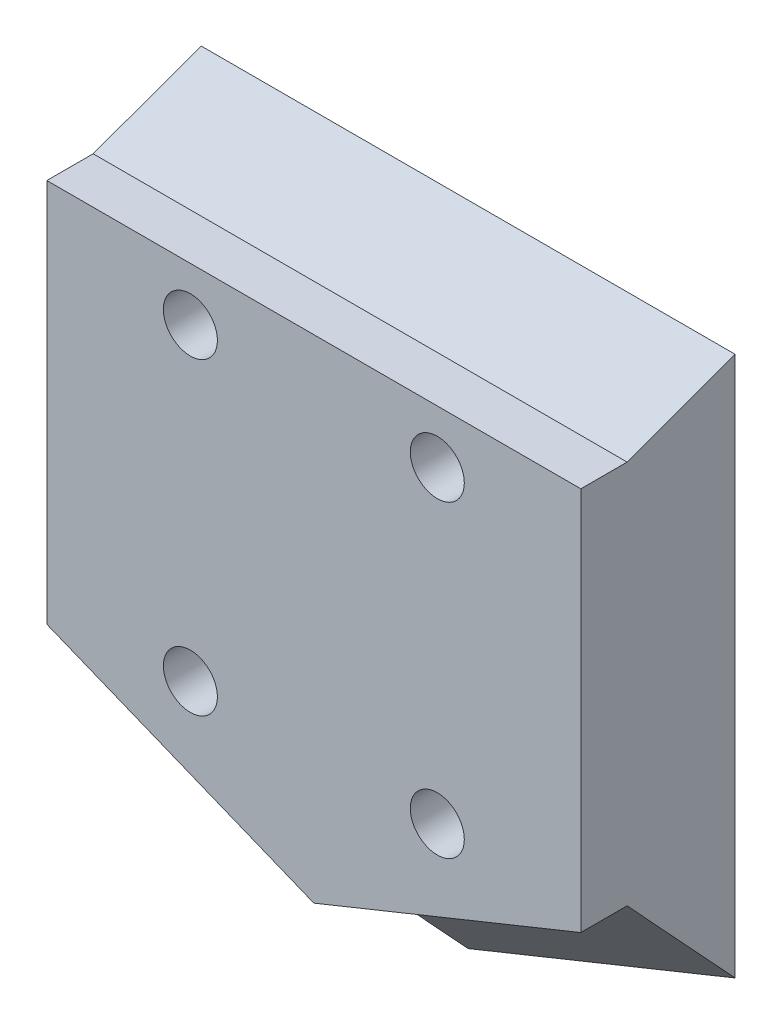
ISO-10303-21;
HEADER;
FILE_DESCRIPTION(('STEP AP214'),'2;1');
FILE_NAME('part.step','',(''),(''),'','','');
FILE_SCHEMA(('AUTOMOTIVE_DESIGN { 1 0 10303 214 1 1 1 1 }'));
ENDSEC;
DATA;
#1=APPLICATION_CONTEXT('core data for automotive mechanical design processes');
#2=APPLICATION_PROTOCOL_DEFINITION('international standard','automotive_design',2000,#1);
#3=PRODUCT_CONTEXT('',#1,'mechanical');
#4=PRODUCT('Part','Part','',(#3));
#5=PRODUCT_RELATED_PRODUCT_CATEGORY('part','',(#4));
#6=PRODUCT_DEFINITION_FORMATION('','',#4);
#7=PRODUCT_DEFINITION_CONTEXT('part definition',#1,'design');
#8=PRODUCT_DEFINITION('design','',#6,#7);
#9=PRODUCT_DEFINITION_SHAPE('','',#8);
#10=(LENGTH_UNIT() NAMED_UNIT(*) SI_UNIT(.MILLI.,.METRE.));
#11=(NAMED_UNIT(*) PLANE_ANGLE_UNIT() SI_UNIT($,.RADIAN.));
#12=(NAMED_UNIT(*) SI_UNIT($,.STERADIAN.) SOLID_ANGLE_UNIT());
#13=UNCERTAINTY_MEASURE_WITH_UNIT(LENGTH_MEASURE(1.E-05),#10,'distance_accuracy_value','');
#14=(GEOMETRIC_REPRESENTATION_CONTEXT(3) GLOBAL_UNCERTAINTY_ASSIGNED_CONTEXT((#13)) GLOBAL_UNIT_ASSIGNED_CONTEXT((#10,
#11,#12)) REPRESENTATION_CONTEXT('',''));
#15=CARTESIAN_POINT('',(0.,0.,0.));
#16=DIRECTION('',(0.,0.,1.));
#17=DIRECTION('',(1.,0.,0.));
#18=AXIS2_PLACEMENT_3D('',#15,#16,#17);
#19=CARTESIAN_POINT('',(-8.,9.5,0.));
#20=DIRECTION('',(0.,0.,1.));
#21=DIRECTION('',(1.,0.,0.));
#22=AXIS2_PLACEMENT_3D('',#19,#20,#21);
#23=CYLINDRICAL_SURFACE('',#22,1.75);
#24=CARTESIAN_POINT('',(-8.,9.5,10.));
#25=DIRECTION('',(0.,0.,1.));
#26=DIRECTION('',(-1.,0.,0.));
#27=AXIS2_PLACEMENT_3D('',#24,#25,#26);
#28=CIRCLE('',#27,1.75);
#29=CARTESIAN_POINT('',(-9.75,9.5,10.));
#30=VERTEX_POINT('',#29);
#31=EDGE_CURVE('E153',#30,#30,#28,.T.);
#32=ORIENTED_EDGE('',*,*,#31,.T.);
#33=EDGE_LOOP('',(#32));
#34=FACE_BOUND('',#33,.T.);
#35=CARTESIAN_POINT('',(-8.,9.5,3.));
#36=DIRECTION('',(0.,0.,-1.));
#37=DIRECTION('',(-1.,0.,0.));
#38=AXIS2_PLACEMENT_3D('',#35,#36,#37);
#39=CIRCLE('',#38,1.75);
#40=CARTESIAN_POINT('',(-9.75,9.5,3.));
#41=VERTEX_POINT('',#40);
#42=EDGE_CURVE('E39',#41,#41,#39,.F.);
#43=ORIENTED_EDGE('',*,*,#42,.F.);
#44=EDGE_LOOP('',(#43));
#45=FACE_BOUND('',#44,.T.);
#46=ADVANCED_FACE('F35',(#34,#45),#23,.F.);
#47=CARTESIAN_POINT('',(-8.,-10.5,0.));
#48=DIRECTION('',(0.,0.,1.));
#49=DIRECTION('',(1.,0.,0.));
#50=AXIS2_PLACEMENT_3D('',#47,#48,#49);
#51=CYLINDRICAL_SURFACE('',#50,1.75);
#52=CARTESIAN_POINT('',(-8.,-10.5,10.));
#53=DIRECTION('',(0.,0.,1.));
#54=DIRECTION('',(-1.,0.,0.));
#55=AXIS2_PLACEMENT_3D('',#52,#53,#54);
#56=CIRCLE('',#55,1.75);
#57=CARTESIAN_POINT('',(-9.75,-10.5,10.));
#58=VERTEX_POINT('',#57);
#59=EDGE_CURVE('E177',#58,#58,#56,.T.);
#60=ORIENTED_EDGE('',*,*,#59,.T.);
#61=EDGE_LOOP('',(#60));
#62=FACE_BOUND('',#61,.T.);
#63=CARTESIAN_POINT('',(-8.,-10.5,3.));
#64=DIRECTION('',(0.,0.,-1.));
#65=DIRECTION('',(-1.,0.,0.));
#66=AXIS2_PLACEMENT_3D('',#63,#64,#65);
#67=CIRCLE('',#66,1.75);
#68=CARTESIAN_POINT('',(-9.75,-10.5,3.));
#69=VERTEX_POINT('',#68);
#70=EDGE_CURVE('E157',#69,#69,#67,.F.);
#71=ORIENTED_EDGE('',*,*,#70,.F.);
#72=EDGE_LOOP('',(#71));
#73=FACE_BOUND('',#72,.T.);
#74=ADVANCED_FACE('F224',(#62,#73),#51,.F.);
#75=CARTESIAN_POINT('',(8.,-10.5,0.));
#76=DIRECTION('',(0.,0.,1.));
#77=DIRECTION('',(1.,0.,0.));
#78=AXIS2_PLACEMENT_3D('',#75,#76,#77);
#79=CYLINDRICAL_SURFACE('',#78,1.75);
#80=CARTESIAN_POINT('',(8.,-10.5,10.));
#81=DIRECTION('',(0.,0.,1.));
#82=DIRECTION('',(1.,0.,0.));
#83=AXIS2_PLACEMENT_3D('',#80,#81,#82);
#84=CIRCLE('',#83,1.75);
#85=CARTESIAN_POINT('',(9.75,-10.5,10.));
#86=VERTEX_POINT('',#85);
#87=EDGE_CURVE('E174',#86,#86,#84,.T.);
#88=ORIENTED_EDGE('',*,*,#87,.T.);
#89=EDGE_LOOP('',(#88));
#90=FACE_BOUND('',#89,.T.);
#91=CARTESIAN_POINT('',(8.,-10.5,3.));
#92=DIRECTION('',(0.,0.,-1.));
#93=DIRECTION('',(-1.,0.,0.));
#94=AXIS2_PLACEMENT_3D('',#91,#92,#93);
#95=CIRCLE('',#94,1.75);
#96=CARTESIAN_POINT('',(6.25,-10.5,3.));
#97=VERTEX_POINT('',#96);
#98=EDGE_CURVE('E155',#97,#97,#95,.F.);
#99=ORIENTED_EDGE('',*,*,#98,.F.);
#100=EDGE_LOOP('',(#99));
#101=FACE_BOUND('',#100,.T.);
#102=ADVANCED_FACE('F230',(#90,#101),#79,.F.);
#103=CARTESIAN_POINT('',(8.,9.50000000000001,0.));
#104=DIRECTION('',(0.,0.,1.));
#105=DIRECTION('',(1.,0.,0.));
#106=AXIS2_PLACEMENT_3D('',#103,#104,#105);
#107=CYLINDRICAL_SURFACE('',#106,1.75);
#108=CARTESIAN_POINT('',(8.,9.50000000000001,10.));
#109=DIRECTION('',(0.,0.,1.));
#110=DIRECTION('',(1.,0.,0.));
#111=AXIS2_PLACEMENT_3D('',#108,#109,#110);
#112=CIRCLE('',#111,1.75);
#113=CARTESIAN_POINT('',(9.75,9.50000000000001,10.));
#114=VERTEX_POINT('',#113);
#115=EDGE_CURVE('E116',#114,#114,#112,.T.);
#116=ORIENTED_EDGE('',*,*,#115,.T.);
#117=EDGE_LOOP('',(#116));
#118=FACE_BOUND('',#117,.T.);
#119=CARTESIAN_POINT('',(8.,9.50000000000001,3.));
#120=DIRECTION('',(0.,0.,-1.));
#121=DIRECTION('',(-1.,0.,0.));
#122=AXIS2_PLACEMENT_3D('',#119,#120,#121);
#123=CIRCLE('',#122,1.75);
#124=CARTESIAN_POINT('',(6.25,9.50000000000001,3.));
#125=VERTEX_POINT('',#124);
#126=EDGE_CURVE('E150',#125,#125,#123,.F.);
#127=ORIENTED_EDGE('',*,*,#126,.F.);
#128=EDGE_LOOP('',(#127));
#129=FACE_BOUND('',#128,.T.);
#130=ADVANCED_FACE('F236',(#118,#129),#107,.F.);
#131=CARTESIAN_POINT('',(17.3,13.,7.));
#132=DIRECTION('',(-1.,0.,0.));
#133=DIRECTION('',(0.,0.,1.));
#134=AXIS2_PLACEMENT_3D('',#131,#132,#133);
#135=PLANE('',#134);
#136=DIRECTION('',(0.,1.,0.));
#137=VECTOR('',#136,1.);
#138=CARTESIAN_POINT('',(17.3,13.,0.));
#139=LINE('',#138,#137);
#140=CARTESIAN_POINT('',(17.3,-19.5,0.));
#141=VERTEX_POINT('',#140);
#142=CARTESIAN_POINT('',(17.3,15.5,0.));
#143=VERTEX_POINT('',#142);
#144=EDGE_CURVE('E136',#141,#143,#139,.T.);
#145=ORIENTED_EDGE('',*,*,#144,.T.);
#146=DIRECTION('',(0.,0.342020143325666,-0.939692620785909));
#147=VECTOR('',#146,1.);
#148=CARTESIAN_POINT('',(17.3,15.5,0.));
#149=LINE('',#148,#147);
#150=CARTESIAN_POINT('',(17.3,12.9522083601366,7.));
#151=VERTEX_POINT('',#150);
#152=EDGE_CURVE('E58',#143,#151,#149,.F.);
#153=ORIENTED_EDGE('',*,*,#152,.T.);
#154=DIRECTION('',(0.,0.,-1.));
#155=VECTOR('',#154,1.);
#156=CARTESIAN_POINT('',(17.3,12.9522083601366,10.));
#157=LINE('',#156,#155);
#158=CARTESIAN_POINT('',(17.3,12.9522083601366,10.));
#159=VERTEX_POINT('',#158);
#160=EDGE_CURVE('E103',#159,#151,#157,.T.);
#161=ORIENTED_EDGE('',*,*,#160,.F.);
#162=DIRECTION('',(0.,1.,0.));
#163=VECTOR('',#162,1.);
#164=CARTESIAN_POINT('',(17.3,-11.9486875651011,10.));
#165=LINE('',#164,#163);
#166=CARTESIAN_POINT('',(17.3,-11.9486875651011,10.));
#167=VERTEX_POINT('',#166);
#168=EDGE_CURVE('E96',#167,#159,#165,.T.);
#169=ORIENTED_EDGE('',*,*,#168,.F.);
#170=DIRECTION('',(0.,0.,-1.));
#171=VECTOR('',#170,1.);
#172=CARTESIAN_POINT('',(17.3,-11.9486875651011,10.));
#173=LINE('',#172,#171);
#174=CARTESIAN_POINT('',(17.3,-11.9486875651011,7.));
#175=VERTEX_POINT('',#174);
#176=EDGE_CURVE('E100',#167,#175,#173,.T.);
#177=ORIENTED_EDGE('',*,*,#176,.T.);
#178=DIRECTION('',(0.,0.733371095333155,0.679828534654032));
#179=VECTOR('',#178,1.);
#180=CARTESIAN_POINT('',(17.3,-19.5,0.));
#181=LINE('',#180,#179);
#182=EDGE_CURVE('E144',#175,#141,#181,.F.);
#183=ORIENTED_EDGE('',*,*,#182,.T.);
#184=EDGE_LOOP('',(#145,#153,#161,#169,#177,#183));
#185=FACE_BOUND('',#184,.T.);
#186=ADVANCED_FACE('F98',(#185),#135,.F.);
#187=CARTESIAN_POINT('',(-17.3,13.,7.));
#188=DIRECTION('',(1.,0.,0.));
#189=DIRECTION('',(0.,1.,0.));
#190=AXIS2_PLACEMENT_3D('',#187,#188,#189);
#191=PLANE('',#190);
#192=DIRECTION('',(0.,-0.733371095333155,-0.679828534654032));
#193=VECTOR('',#192,1.);
#194=CARTESIAN_POINT('',(-17.3,-23.2648321442911,-3.48996617968573));
#195=LINE('',#194,#193);
#196=CARTESIAN_POINT('',(-17.3,-19.5,0.));
#197=VERTEX_POINT('',#196);
#198=CARTESIAN_POINT('',(-17.3,-11.9486875651011,7.));
#199=VERTEX_POINT('',#198);
#200=EDGE_CURVE('E146',#197,#199,#195,.F.);
#201=ORIENTED_EDGE('',*,*,#200,.T.);
#202=DIRECTION('',(0.,0.,-1.));
#203=VECTOR('',#202,1.);
#204=CARTESIAN_POINT('',(-17.3,-11.9486875651011,10.));
#205=LINE('',#204,#203);
#206=CARTESIAN_POINT('',(-17.3,-11.9486875651011,10.));
#207=VERTEX_POINT('',#206);
#208=EDGE_CURVE('E190',#207,#199,#205,.T.);
#209=ORIENTED_EDGE('',*,*,#208,.F.);
#210=DIRECTION('',(0.,-1.,0.));
#211=VECTOR('',#210,1.);
#212=CARTESIAN_POINT('',(-17.3,12.9522083601366,10.));
#213=LINE('',#212,#211);
#214=CARTESIAN_POINT('',(-17.3,12.9522083601366,10.));
#215=VERTEX_POINT('',#214);
#216=EDGE_CURVE('E185',#215,#207,#213,.T.);
#217=ORIENTED_EDGE('',*,*,#216,.F.);
#218=DIRECTION('',(0.,0.,-1.));
#219=VECTOR('',#218,1.);
#220=CARTESIAN_POINT('',(-17.3,12.9522083601366,10.));
#221=LINE('',#220,#219);
#222=CARTESIAN_POINT('',(-17.3,12.9522083601366,7.));
#223=VERTEX_POINT('',#222);
#224=EDGE_CURVE('E124',#215,#223,#221,.T.);
#225=ORIENTED_EDGE('',*,*,#224,.T.);
#226=DIRECTION('',(0.,-0.342020143325666,0.939692620785909));
#227=VECTOR('',#226,1.);
#228=CARTESIAN_POINT('',(-17.3,15.5,0.));
#229=LINE('',#228,#227);
#230=CARTESIAN_POINT('',(-17.3,15.5,0.));
#231=VERTEX_POINT('',#230);
#232=EDGE_CURVE('E11',#223,#231,#229,.F.);
#233=ORIENTED_EDGE('',*,*,#232,.T.);
#234=DIRECTION('',(0.,-1.,0.));
#235=VECTOR('',#234,1.);
#236=CARTESIAN_POINT('',(-17.3,13.,0.));
#237=LINE('',#236,#235);
#238=EDGE_CURVE('E138',#231,#197,#237,.T.);
#239=ORIENTED_EDGE('',*,*,#238,.T.);
#240=EDGE_LOOP('',(#201,#209,#217,#225,#233,#239));
#241=FACE_BOUND('',#240,.T.);
#242=ADVANCED_FACE('F196',(#241),#191,.F.);
#243=CARTESIAN_POINT('',(0.,0.,0.));
#244=DIRECTION('',(0.,0.,1.));
#245=DIRECTION('',(1.,0.,0.));
#246=AXIS2_PLACEMENT_3D('',#243,#244,#245);
#247=PLANE('',#246);
#248=CARTESIAN_POINT('',(-8.,9.5,0.));
#249=DIRECTION('',(0.,0.,-1.));
#250=DIRECTION('',(-1.,0.,0.));
#251=AXIS2_PLACEMENT_3D('',#248,#249,#250);
#252=CIRCLE('',#251,3.5);
#253=CARTESIAN_POINT('',(-11.5,9.5,0.));
#254=VERTEX_POINT('',#253);
#255=EDGE_CURVE('E286',#254,#254,#252,.T.);
#256=ORIENTED_EDGE('',*,*,#255,.F.);
#257=EDGE_LOOP('',(#256));
#258=FACE_BOUND('',#257,.T.);
#259=CARTESIAN_POINT('',(8.,-10.5,0.));
#260=DIRECTION('',(0.,0.,-1.));
#261=DIRECTION('',(-1.,0.,0.));
#262=AXIS2_PLACEMENT_3D('',#259,#260,#261);
#263=CIRCLE('',#262,3.5);
#264=CARTESIAN_POINT('',(4.5,-10.5,0.));
#265=VERTEX_POINT('',#264);
#266=EDGE_CURVE('E294',#265,#265,#263,.T.);
#267=ORIENTED_EDGE('',*,*,#266,.F.);
#268=EDGE_LOOP('',(#267));
#269=FACE_BOUND('',#268,.T.);
#270=CARTESIAN_POINT('',(-8.,-10.5,0.));
#271=DIRECTION('',(0.,0.,-1.));
#272=DIRECTION('',(-1.,0.,0.));
#273=AXIS2_PLACEMENT_3D('',#270,#271,#272);
#274=CIRCLE('',#273,3.5);
#275=CARTESIAN_POINT('',(-11.5,-10.5,0.));
#276=VERTEX_POINT('',#275);
#277=EDGE_CURVE('E299',#276,#276,#274,.T.);
#278=ORIENTED_EDGE('',*,*,#277,.F.);
#279=EDGE_LOOP('',(#278));
#280=FACE_BOUND('',#279,.T.);
#281=CARTESIAN_POINT('',(8.,9.50000000000001,0.));
#282=DIRECTION('',(0.,0.,-1.));
#283=DIRECTION('',(-1.,0.,0.));
#284=AXIS2_PLACEMENT_3D('',#281,#282,#283);
#285=CIRCLE('',#284,3.5);
#286=CARTESIAN_POINT('',(4.5,9.50000000000001,0.));
#287=VERTEX_POINT('',#286);
#288=EDGE_CURVE('E163',#287,#287,#285,.T.);
#289=ORIENTED_EDGE('',*,*,#288,.F.);
#290=EDGE_LOOP('',(#289));
#291=FACE_BOUND('',#290,.T.);
#292=ORIENTED_EDGE('',*,*,#144,.F.);
#293=DIRECTION('',(-0.926991176745522,-0.375083135099344,0.));
#294=VECTOR('',#293,1.);
#295=CARTESIAN_POINT('',(17.3,-19.5,0.));
#296=LINE('',#295,#294);
#297=CARTESIAN_POINT('',(0.,-26.5,0.));
#298=VERTEX_POINT('',#297);
#299=EDGE_CURVE('E122',#141,#298,#296,.T.);
#300=ORIENTED_EDGE('',*,*,#299,.T.);
#301=DIRECTION('',(-0.926991176745522,0.375083135099344,0.));
#302=VECTOR('',#301,1.);
#303=CARTESIAN_POINT('',(0.,-26.5,0.));
#304=LINE('',#303,#302);
#305=EDGE_CURVE('E128',#298,#197,#304,.T.);
#306=ORIENTED_EDGE('',*,*,#305,.T.);
#307=ORIENTED_EDGE('',*,*,#238,.F.);
#308=DIRECTION('',(1.,0.,0.));
#309=VECTOR('',#308,1.);
#310=CARTESIAN_POINT('',(17.3,15.5,0.));
#311=LINE('',#310,#309);
#312=EDGE_CURVE('E131',#231,#143,#311,.T.);
#313=ORIENTED_EDGE('',*,*,#312,.T.);
#314=EDGE_LOOP('',(#292,#300,#306,#307,#313));
#315=FACE_BOUND('',#314,.T.);
#316=ADVANCED_FACE('F204',(#258,#269,#280,#291,#315),#247,.F.);
#317=CARTESIAN_POINT('',(0.,-26.5,0.));
#318=DIRECTION('',(0.265223828337456,0.655481747176855,-0.707106781186549));
#319=DIRECTION('',(-0.926991176745522,0.375083135099344,0.));
#320=AXIS2_PLACEMENT_3D('',#317,#318,#319);
#321=PLANE('',#320);
#322=ORIENTED_EDGE('',*,*,#200,.F.);
#323=ORIENTED_EDGE('',*,*,#305,.F.);
#324=DIRECTION('',(0.,0.733371095333155,0.679828534654032));
#325=VECTOR('',#324,1.);
#326=CARTESIAN_POINT('',(0.,-26.5,0.));
#327=LINE('',#326,#325);
#328=CARTESIAN_POINT('',(0.,-18.9486875651011,7.));
#329=VERTEX_POINT('',#328);
#330=EDGE_CURVE('E120',#329,#298,#327,.F.);
#331=ORIENTED_EDGE('',*,*,#330,.F.);
#332=DIRECTION('',(0.926991176745522,-0.375083135099344,0.));
#333=VECTOR('',#332,1.);
#334=CARTESIAN_POINT('',(-6.5884351090578,-16.2828467695286,7.));
#335=LINE('',#334,#333);
#336=EDGE_CURVE('E140',#199,#329,#335,.T.);
#337=ORIENTED_EDGE('',*,*,#336,.F.);
#338=EDGE_LOOP('',(#322,#323,#331,#337));
#339=FACE_BOUND('',#338,.T.);
#340=ADVANCED_FACE('F210',(#339),#321,.F.);
#341=CARTESIAN_POINT('',(17.3,-19.5,0.));
#342=DIRECTION('',(-0.265223828337456,0.655481747176855,-0.707106781186549));
#343=DIRECTION('',(-0.926991176745522,-0.375083135099344,0.));
#344=AXIS2_PLACEMENT_3D('',#341,#342,#343);
#345=PLANE('',#344);
#346=ORIENTED_EDGE('',*,*,#182,.F.);
#347=DIRECTION('',(0.926991176745522,0.375083135099344,0.));
#348=VECTOR('',#347,1.);
#349=CARTESIAN_POINT('',(6.5884351090578,-16.2828467695286,7.));
#350=LINE('',#349,#348);
#351=EDGE_CURVE('E119',#329,#175,#350,.T.);
#352=ORIENTED_EDGE('',*,*,#351,.F.);
#353=ORIENTED_EDGE('',*,*,#330,.T.);
#354=ORIENTED_EDGE('',*,*,#299,.F.);
#355=EDGE_LOOP('',(#346,#352,#353,#354));
#356=FACE_BOUND('',#355,.T.);
#357=ADVANCED_FACE('F312',(#356),#345,.F.);
#358=CARTESIAN_POINT('',(17.3,15.5,0.));
#359=DIRECTION('',(0.,-0.939692620785909,-0.342020143325666));
#360=DIRECTION('',(1.,0.,0.));
#361=AXIS2_PLACEMENT_3D('',#358,#359,#360);
#362=PLANE('',#361);
#363=ORIENTED_EDGE('',*,*,#232,.F.);
#364=DIRECTION('',(-1.,0.,0.));
#365=VECTOR('',#364,1.);
#366=CARTESIAN_POINT('',(0.,12.9522083601366,7.));
#367=LINE('',#366,#365);
#368=EDGE_CURVE('E44',#151,#223,#367,.T.);
#369=ORIENTED_EDGE('',*,*,#368,.F.);
#370=ORIENTED_EDGE('',*,*,#152,.F.);
#371=ORIENTED_EDGE('',*,*,#312,.F.);
#372=EDGE_LOOP('',(#363,#369,#370,#371));
#373=FACE_BOUND('',#372,.T.);
#374=ADVANCED_FACE('F37',(#373),#362,.F.);
#375=CARTESIAN_POINT('',(0.,-18.9486875651011,10.));
#376=DIRECTION('',(-0.375083135099344,0.926991176745522,0.));
#377=DIRECTION('',(-0.926991176745522,-0.375083135099344,0.));
#378=AXIS2_PLACEMENT_3D('',#375,#376,#377);
#379=PLANE('',#378);
#380=ORIENTED_EDGE('',*,*,#351,.T.);
#381=ORIENTED_EDGE('',*,*,#176,.F.);
#382=DIRECTION('',(0.926991176745522,0.375083135099345,0.));
#383=VECTOR('',#382,1.);
#384=CARTESIAN_POINT('',(0.,-18.9486875651011,10.));
#385=LINE('',#384,#383);
#386=CARTESIAN_POINT('',(0.,-18.9486875651011,10.));
#387=VERTEX_POINT('',#386);
#388=EDGE_CURVE('E107',#387,#167,#385,.T.);
#389=ORIENTED_EDGE('',*,*,#388,.F.);
#390=DIRECTION('',(0.,0.,-1.));
#391=VECTOR('',#390,1.);
#392=CARTESIAN_POINT('',(0.,-18.9486875651011,10.));
#393=LINE('',#392,#391);
#394=EDGE_CURVE('E188',#387,#329,#393,.T.);
#395=ORIENTED_EDGE('',*,*,#394,.T.);
#396=EDGE_LOOP('',(#380,#381,#389,#395));
#397=FACE_BOUND('',#396,.T.);
#398=ADVANCED_FACE('F118',(#397),#379,.F.);
#399=CARTESIAN_POINT('',(17.3,12.9522083601366,10.));
#400=DIRECTION('',(0.,-1.,0.));
#401=DIRECTION('',(0.,0.,-1.));
#402=AXIS2_PLACEMENT_3D('',#399,#400,#401);
#403=PLANE('',#402);
#404=ORIENTED_EDGE('',*,*,#368,.T.);
#405=ORIENTED_EDGE('',*,*,#224,.F.);
#406=DIRECTION('',(-1.,0.,0.));
#407=VECTOR('',#406,1.);
#408=CARTESIAN_POINT('',(17.3,12.9522083601366,10.));
#409=LINE('',#408,#407);
#410=EDGE_CURVE('E106',#159,#215,#409,.T.);
#411=ORIENTED_EDGE('',*,*,#410,.F.);
#412=ORIENTED_EDGE('',*,*,#160,.T.);
#413=EDGE_LOOP('',(#404,#405,#411,#412));
#414=FACE_BOUND('',#413,.T.);
#415=ADVANCED_FACE('F200',(#414),#403,.F.);
#416=CARTESIAN_POINT('',(-17.3,-11.9486875651011,10.));
#417=DIRECTION('',(0.375083135099344,0.926991176745522,0.));
#418=DIRECTION('',(-0.926991176745522,0.375083135099345,0.));
#419=AXIS2_PLACEMENT_3D('',#416,#417,#418);
#420=PLANE('',#419);
#421=ORIENTED_EDGE('',*,*,#336,.T.);
#422=ORIENTED_EDGE('',*,*,#394,.F.);
#423=DIRECTION('',(0.926991176745521,-0.375083135099344,0.));
#424=VECTOR('',#423,1.);
#425=CARTESIAN_POINT('',(-17.3,-11.9486875651011,10.));
#426=LINE('',#425,#424);
#427=EDGE_CURVE('E112',#207,#387,#426,.T.);
#428=ORIENTED_EDGE('',*,*,#427,.F.);
#429=ORIENTED_EDGE('',*,*,#208,.T.);
#430=EDGE_LOOP('',(#421,#422,#428,#429));
#431=FACE_BOUND('',#430,.T.);
#432=ADVANCED_FACE('F212',(#431),#420,.F.);
#433=CARTESIAN_POINT('',(0.,0.,10.));
#434=DIRECTION('',(0.,0.,1.));
#435=DIRECTION('',(1.,0.,0.));
#436=AXIS2_PLACEMENT_3D('',#433,#434,#435);
#437=PLANE('',#436);
#438=ORIENTED_EDGE('',*,*,#87,.F.);
#439=EDGE_LOOP('',(#438));
#440=FACE_BOUND('',#439,.T.);
#441=ORIENTED_EDGE('',*,*,#59,.F.);
#442=EDGE_LOOP('',(#441));
#443=FACE_BOUND('',#442,.T.);
#444=ORIENTED_EDGE('',*,*,#31,.F.);
#445=EDGE_LOOP('',(#444));
#446=FACE_BOUND('',#445,.T.);
#447=ORIENTED_EDGE('',*,*,#115,.F.);
#448=EDGE_LOOP('',(#447));
#449=FACE_BOUND('',#448,.T.);
#450=ORIENTED_EDGE('',*,*,#388,.T.);
#451=ORIENTED_EDGE('',*,*,#168,.T.);
#452=ORIENTED_EDGE('',*,*,#410,.T.);
#453=ORIENTED_EDGE('',*,*,#216,.T.);
#454=ORIENTED_EDGE('',*,*,#427,.T.);
#455=EDGE_LOOP('',(#450,#451,#452,#453,#454));
#456=FACE_BOUND('',#455,.T.);
#457=ADVANCED_FACE('F110',(#440,#443,#446,#449,#456),#437,.T.);
#458=CARTESIAN_POINT('',(8.,9.50000000000001,3.));
#459=DIRECTION('',(0.,0.,-1.));
#460=DIRECTION('',(-1.,0.,0.));
#461=AXIS2_PLACEMENT_3D('',#458,#459,#460);
#462=PLANE('',#461);
#463=CARTESIAN_POINT('',(8.,9.50000000000001,3.));
#464=DIRECTION('',(0.,0.,-1.));
#465=DIRECTION('',(-1.,0.,0.));
#466=AXIS2_PLACEMENT_3D('',#463,#464,#465);
#467=CIRCLE('',#466,3.5);
#468=CARTESIAN_POINT('',(4.5,9.50000000000001,3.));
#469=VERTEX_POINT('',#468);
#470=EDGE_CURVE('E154',#469,#469,#467,.T.);
#471=ORIENTED_EDGE('',*,*,#470,.T.);
#472=EDGE_LOOP('',(#471));
#473=FACE_BOUND('',#472,.T.);
#474=ORIENTED_EDGE('',*,*,#126,.T.);
#475=EDGE_LOOP('',(#474));
#476=FACE_BOUND('',#475,.T.);
#477=ADVANCED_FACE('F219',(#473,#476),#462,.T.);
#478=CARTESIAN_POINT('',(8.,9.50000000000001,3.));
#479=DIRECTION('',(0.,0.,-1.));
#480=DIRECTION('',(-1.,0.,0.));
#481=AXIS2_PLACEMENT_3D('',#478,#479,#480);
#482=CYLINDRICAL_SURFACE('',#481,3.5);
#483=ORIENTED_EDGE('',*,*,#470,.F.);
#484=EDGE_LOOP('',(#483));
#485=FACE_BOUND('',#484,.T.);
#486=ORIENTED_EDGE('',*,*,#288,.T.);
#487=EDGE_LOOP('',(#486));
#488=FACE_BOUND('',#487,.T.);
#489=ADVANCED_FACE('F250',(#485,#488),#482,.F.);
#490=CARTESIAN_POINT('',(8.,-10.5,3.));
#491=DIRECTION('',(0.,0.,-1.));
#492=DIRECTION('',(-1.,0.,0.));
#493=AXIS2_PLACEMENT_3D('',#490,#491,#492);
#494=PLANE('',#493);
#495=CARTESIAN_POINT('',(8.,-10.5,3.));
#496=DIRECTION('',(0.,0.,-1.));
#497=DIRECTION('',(-1.,0.,0.));
#498=AXIS2_PLACEMENT_3D('',#495,#496,#497);
#499=CIRCLE('',#498,3.5);
#500=CARTESIAN_POINT('',(4.5,-10.5,3.));
#501=VERTEX_POINT('',#500);
#502=EDGE_CURVE('E289',#501,#501,#499,.T.);
#503=ORIENTED_EDGE('',*,*,#502,.T.);
#504=EDGE_LOOP('',(#503));
#505=FACE_BOUND('',#504,.T.);
#506=ORIENTED_EDGE('',*,*,#98,.T.);
#507=EDGE_LOOP('',(#506));
#508=FACE_BOUND('',#507,.T.);
#509=ADVANCED_FACE('F256',(#505,#508),#494,.T.);
#510=CARTESIAN_POINT('',(8.,-10.5,3.));
#511=DIRECTION('',(0.,0.,-1.));
#512=DIRECTION('',(-1.,0.,0.));
#513=AXIS2_PLACEMENT_3D('',#510,#511,#512);
#514=CYLINDRICAL_SURFACE('',#513,3.5);
#515=ORIENTED_EDGE('',*,*,#502,.F.);
#516=EDGE_LOOP('',(#515));
#517=FACE_BOUND('',#516,.T.);
#518=ORIENTED_EDGE('',*,*,#266,.T.);
#519=EDGE_LOOP('',(#518));
#520=FACE_BOUND('',#519,.T.);
#521=ADVANCED_FACE('F268',(#517,#520),#514,.F.);
#522=CARTESIAN_POINT('',(-8.,-10.5,3.));
#523=DIRECTION('',(0.,0.,-1.));
#524=DIRECTION('',(-1.,0.,0.));
#525=AXIS2_PLACEMENT_3D('',#522,#523,#524);
#526=PLANE('',#525);
#527=CARTESIAN_POINT('',(-8.,-10.5,3.));
#528=DIRECTION('',(0.,0.,-1.));
#529=DIRECTION('',(-1.,0.,0.));
#530=AXIS2_PLACEMENT_3D('',#527,#528,#529);
#531=CIRCLE('',#530,3.5);
#532=CARTESIAN_POINT('',(-11.5,-10.5,3.));
#533=VERTEX_POINT('',#532);
#534=EDGE_CURVE('E297',#533,#533,#531,.T.);
#535=ORIENTED_EDGE('',*,*,#534,.T.);
#536=EDGE_LOOP('',(#535));
#537=FACE_BOUND('',#536,.T.);
#538=ORIENTED_EDGE('',*,*,#70,.T.);
#539=EDGE_LOOP('',(#538));
#540=FACE_BOUND('',#539,.T.);
#541=ADVANCED_FACE('F264',(#537,#540),#526,.T.);
#542=CARTESIAN_POINT('',(-8.,-10.5,3.));
#543=DIRECTION('',(0.,0.,-1.));
#544=DIRECTION('',(-1.,0.,0.));
#545=AXIS2_PLACEMENT_3D('',#542,#543,#544);
#546=CYLINDRICAL_SURFACE('',#545,3.5);
#547=ORIENTED_EDGE('',*,*,#534,.F.);
#548=EDGE_LOOP('',(#547));
#549=FACE_BOUND('',#548,.T.);
#550=ORIENTED_EDGE('',*,*,#277,.T.);
#551=EDGE_LOOP('',(#550));
#552=FACE_BOUND('',#551,.T.);
#553=ADVANCED_FACE('F260',(#549,#552),#546,.F.);
#554=CARTESIAN_POINT('',(-8.,9.5,3.));
#555=DIRECTION('',(0.,0.,-1.));
#556=DIRECTION('',(-1.,0.,0.));
#557=AXIS2_PLACEMENT_3D('',#554,#555,#556);
#558=PLANE('',#557);
#559=CARTESIAN_POINT('',(-8.,9.5,3.));
#560=DIRECTION('',(0.,0.,-1.));
#561=DIRECTION('',(-1.,0.,0.));
#562=AXIS2_PLACEMENT_3D('',#559,#560,#561);
#563=CIRCLE('',#562,3.5);
#564=CARTESIAN_POINT('',(-11.5,9.5,3.));
#565=VERTEX_POINT('',#564);
#566=EDGE_CURVE('E158',#565,#565,#563,.T.);
#567=ORIENTED_EDGE('',*,*,#566,.T.);
#568=EDGE_LOOP('',(#567));
#569=FACE_BOUND('',#568,.T.);
#570=ORIENTED_EDGE('',*,*,#42,.T.);
#571=EDGE_LOOP('',(#570));
#572=FACE_BOUND('',#571,.T.);
#573=ADVANCED_FACE('F263',(#569,#572),#558,.T.);
#574=CARTESIAN_POINT('',(-8.,9.5,3.));
#575=DIRECTION('',(0.,0.,-1.));
#576=DIRECTION('',(-1.,0.,0.));
#577=AXIS2_PLACEMENT_3D('',#574,#575,#576);
#578=CYLINDRICAL_SURFACE('',#577,3.5);
#579=ORIENTED_EDGE('',*,*,#566,.F.);
#580=EDGE_LOOP('',(#579));
#581=FACE_BOUND('',#580,.T.);
#582=ORIENTED_EDGE('',*,*,#255,.T.);
#583=EDGE_LOOP('',(#582));
#584=FACE_BOUND('',#583,.T.);
#585=ADVANCED_FACE('F276',(#581,#584),#578,.F.);
#586=CLOSED_SHELL('',(#46,#74,#102,#130,#186,#242,#316,#340,#357,#374,#398,#415,#432,#457,#477,
#489,#509,#521,#541,#553,#573,#585));
#587=MANIFOLD_SOLID_BREP('B2',#586);
#588=ADVANCED_BREP_SHAPE_REPRESENTATION('',(#18,#587),#14);
#589=SHAPE_DEFINITION_REPRESENTATION(#9,#588);
ENDSEC;
END-ISO-10303-21;
